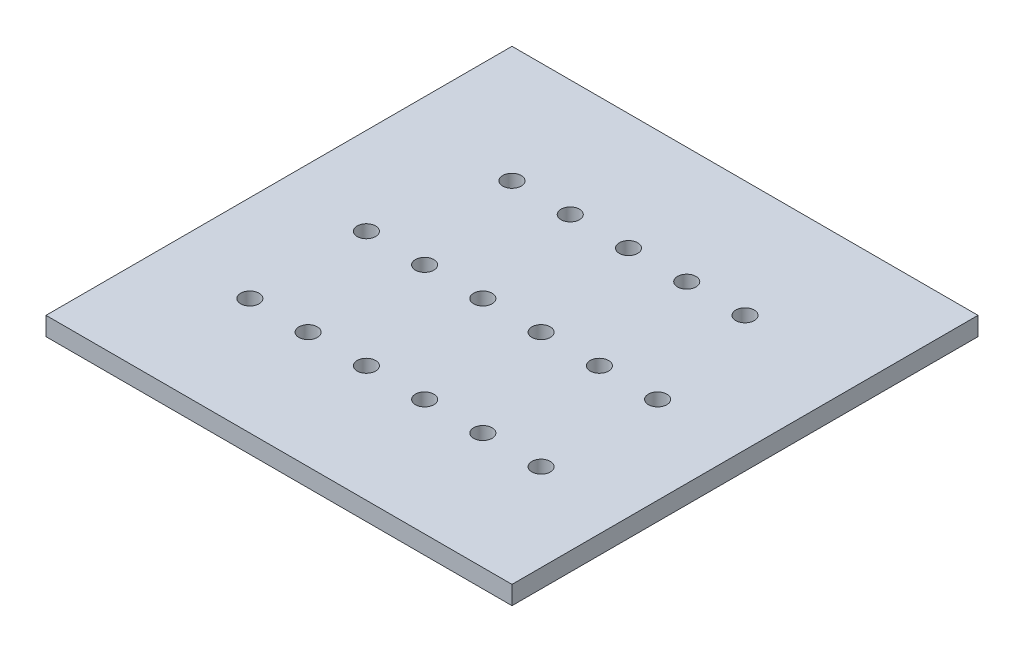
ISO-10303-21;
HEADER;
FILE_DESCRIPTION(('STEP AP214'),'2;1');
FILE_NAME('part.step','',(''),(''),'','','');
FILE_SCHEMA(('AUTOMOTIVE_DESIGN { 1 0 10303 214 1 1 1 1 }'));
ENDSEC;
DATA;
#1=APPLICATION_CONTEXT('core data for automotive mechanical design processes');
#2=APPLICATION_PROTOCOL_DEFINITION('international standard','automotive_design',2000,#1);
#3=PRODUCT_CONTEXT('',#1,'mechanical');
#4=PRODUCT('Part','Part','',(#3));
#5=PRODUCT_RELATED_PRODUCT_CATEGORY('part','',(#4));
#6=PRODUCT_DEFINITION_FORMATION('','',#4);
#7=PRODUCT_DEFINITION_CONTEXT('part definition',#1,'design');
#8=PRODUCT_DEFINITION('design','',#6,#7);
#9=PRODUCT_DEFINITION_SHAPE('','',#8);
#10=(LENGTH_UNIT() NAMED_UNIT(*) SI_UNIT(.MILLI.,.METRE.));
#11=(NAMED_UNIT(*) PLANE_ANGLE_UNIT() SI_UNIT($,.RADIAN.));
#12=(NAMED_UNIT(*) SI_UNIT($,.STERADIAN.) SOLID_ANGLE_UNIT());
#13=UNCERTAINTY_MEASURE_WITH_UNIT(LENGTH_MEASURE(1.E-05),#10,'distance_accuracy_value','');
#14=(GEOMETRIC_REPRESENTATION_CONTEXT(3) GLOBAL_UNCERTAINTY_ASSIGNED_CONTEXT((#13)) GLOBAL_UNIT_ASSIGNED_CONTEXT((#10,
#11,#12)) REPRESENTATION_CONTEXT('',''));
#15=CARTESIAN_POINT('',(0.,0.,0.));
#16=DIRECTION('',(0.,0.,1.));
#17=DIRECTION('',(1.,0.,0.));
#18=AXIS2_PLACEMENT_3D('',#15,#16,#17);
#19=CARTESIAN_POINT('',(0.,4.7625,0.));
#20=DIRECTION('',(0.,-1.,0.));
#21=DIRECTION('',(0.,0.,-1.));
#22=AXIS2_PLACEMENT_3D('',#19,#20,#21);
#23=PLANE('',#22);
#24=CARTESIAN_POINT('',(82.5,4.7625,-30.));
#25=DIRECTION('',(0.,1.,0.));
#26=DIRECTION('',(0.,0.,1.));
#27=AXIS2_PLACEMENT_3D('',#24,#25,#26);
#28=CIRCLE('',#27,2.375);
#29=CARTESIAN_POINT('',(82.5,4.7625,-27.625));
#30=VERTEX_POINT('',#29);
#31=EDGE_CURVE('E200',#30,#30,#28,.T.);
#32=ORIENTED_EDGE('',*,*,#31,.F.);
#33=EDGE_LOOP('',(#32));
#34=FACE_BOUND('',#33,.T.);
#35=CARTESIAN_POINT('',(52.5,4.7625,-30.));
#36=DIRECTION('',(0.,1.,0.));
#37=DIRECTION('',(0.,0.,1.));
#38=AXIS2_PLACEMENT_3D('',#35,#36,#37);
#39=CIRCLE('',#38,2.375);
#40=CARTESIAN_POINT('',(52.5,4.7625,-27.625));
#41=VERTEX_POINT('',#40);
#42=EDGE_CURVE('E188',#41,#41,#39,.T.);
#43=ORIENTED_EDGE('',*,*,#42,.F.);
#44=EDGE_LOOP('',(#43));
#45=FACE_BOUND('',#44,.T.);
#46=CARTESIAN_POINT('',(22.5,4.7625,-60.));
#47=DIRECTION('',(0.,1.,0.));
#48=DIRECTION('',(0.,0.,-1.));
#49=AXIS2_PLACEMENT_3D('',#46,#47,#48);
#50=CIRCLE('',#49,2.375);
#51=CARTESIAN_POINT('',(22.5,4.7625,-62.375));
#52=VERTEX_POINT('',#51);
#53=EDGE_CURVE('E176',#52,#52,#50,.T.);
#54=ORIENTED_EDGE('',*,*,#53,.F.);
#55=EDGE_LOOP('',(#54));
#56=FACE_BOUND('',#55,.T.);
#57=CARTESIAN_POINT('',(37.5,4.7625,-60.));
#58=DIRECTION('',(0.,1.,0.));
#59=DIRECTION('',(0.,0.,-1.));
#60=AXIS2_PLACEMENT_3D('',#57,#58,#59);
#61=CIRCLE('',#60,2.375);
#62=CARTESIAN_POINT('',(37.5,4.7625,-62.375));
#63=VERTEX_POINT('',#62);
#64=EDGE_CURVE('E164',#63,#63,#61,.T.);
#65=ORIENTED_EDGE('',*,*,#64,.F.);
#66=EDGE_LOOP('',(#65));
#67=FACE_BOUND('',#66,.T.);
#68=CARTESIAN_POINT('',(67.4999999999999,4.7625,-60.));
#69=DIRECTION('',(0.,1.,0.));
#70=DIRECTION('',(0.,0.,-1.));
#71=AXIS2_PLACEMENT_3D('',#68,#69,#70);
#72=CIRCLE('',#71,2.375);
#73=CARTESIAN_POINT('',(67.4999999999999,4.7625,-62.375));
#74=VERTEX_POINT('',#73);
#75=EDGE_CURVE('E152',#74,#74,#72,.T.);
#76=ORIENTED_EDGE('',*,*,#75,.F.);
#77=EDGE_LOOP('',(#76));
#78=FACE_BOUND('',#77,.T.);
#79=CARTESIAN_POINT('',(97.4999999999999,4.7625,-60.));
#80=DIRECTION('',(0.,1.,0.));
#81=DIRECTION('',(0.,0.,-1.));
#82=AXIS2_PLACEMENT_3D('',#79,#80,#81);
#83=CIRCLE('',#82,2.375);
#84=CARTESIAN_POINT('',(97.4999999999999,4.7625,-62.375));
#85=VERTEX_POINT('',#84);
#86=EDGE_CURVE('E140',#85,#85,#83,.T.);
#87=ORIENTED_EDGE('',*,*,#86,.F.);
#88=EDGE_LOOP('',(#87));
#89=FACE_BOUND('',#88,.T.);
#90=CARTESIAN_POINT('',(75.,4.7625,-90.));
#91=DIRECTION('',(0.,1.,0.));
#92=DIRECTION('',(0.,0.,1.));
#93=AXIS2_PLACEMENT_3D('',#90,#91,#92);
#94=CIRCLE('',#93,2.375);
#95=CARTESIAN_POINT('',(75.,4.7625,-87.625));
#96=VERTEX_POINT('',#95);
#97=EDGE_CURVE('E128',#96,#96,#94,.T.);
#98=ORIENTED_EDGE('',*,*,#97,.F.);
#99=EDGE_LOOP('',(#98));
#100=FACE_BOUND('',#99,.T.);
#101=CARTESIAN_POINT('',(45.,4.7625,-90.));
#102=DIRECTION('',(0.,1.,0.));
#103=DIRECTION('',(0.,0.,1.));
#104=AXIS2_PLACEMENT_3D('',#101,#102,#103);
#105=CIRCLE('',#104,2.375);
#106=CARTESIAN_POINT('',(45.,4.7625,-87.625));
#107=VERTEX_POINT('',#106);
#108=EDGE_CURVE('E116',#107,#107,#105,.T.);
#109=ORIENTED_EDGE('',*,*,#108,.F.);
#110=EDGE_LOOP('',(#109));
#111=FACE_BOUND('',#110,.T.);
#112=DIRECTION('',(0.,0.,1.));
#113=VECTOR('',#112,1.);
#114=CARTESIAN_POINT('',(0.,4.7625,0.));
#115=LINE('',#114,#113);
#116=CARTESIAN_POINT('',(0.,4.7625,-120.));
#117=VERTEX_POINT('',#116);
#118=CARTESIAN_POINT('',(0.,4.7625,0.));
#119=VERTEX_POINT('',#118);
#120=EDGE_CURVE('E86',#117,#119,#115,.T.);
#121=ORIENTED_EDGE('',*,*,#120,.T.);
#122=DIRECTION('',(1.,0.,0.));
#123=VECTOR('',#122,1.);
#124=CARTESIAN_POINT('',(0.,4.7625,0.));
#125=LINE('',#124,#123);
#126=CARTESIAN_POINT('',(120.,4.7625,0.));
#127=VERTEX_POINT('',#126);
#128=EDGE_CURVE('E81',#119,#127,#125,.T.);
#129=ORIENTED_EDGE('',*,*,#128,.T.);
#130=DIRECTION('',(0.,0.,-1.));
#131=VECTOR('',#130,1.);
#132=CARTESIAN_POINT('',(120.,4.7625,0.));
#133=LINE('',#132,#131);
#134=CARTESIAN_POINT('',(120.,4.7625,-120.));
#135=VERTEX_POINT('',#134);
#136=EDGE_CURVE('E84',#127,#135,#133,.T.);
#137=ORIENTED_EDGE('',*,*,#136,.T.);
#138=DIRECTION('',(-1.,0.,0.));
#139=VECTOR('',#138,1.);
#140=CARTESIAN_POINT('',(0.,4.7625,-120.));
#141=LINE('',#140,#139);
#142=EDGE_CURVE('E51',#135,#117,#141,.T.);
#143=ORIENTED_EDGE('',*,*,#142,.T.);
#144=EDGE_LOOP('',(#121,#129,#137,#143));
#145=FACE_BOUND('',#144,.T.);
#146=CARTESIAN_POINT('',(30.,4.7625,-90.));
#147=DIRECTION('',(0.,1.,0.));
#148=DIRECTION('',(0.,0.,1.));
#149=AXIS2_PLACEMENT_3D('',#146,#147,#148);
#150=CIRCLE('',#149,2.375);
#151=CARTESIAN_POINT('',(30.,4.7625,-87.625));
#152=VERTEX_POINT('',#151);
#153=EDGE_CURVE('E101',#152,#152,#150,.T.);
#154=ORIENTED_EDGE('',*,*,#153,.F.);
#155=EDGE_LOOP('',(#154));
#156=FACE_BOUND('',#155,.T.);
#157=CARTESIAN_POINT('',(60.,4.7625,-90.));
#158=DIRECTION('',(0.,1.,0.));
#159=DIRECTION('',(0.,0.,1.));
#160=AXIS2_PLACEMENT_3D('',#157,#158,#159);
#161=CIRCLE('',#160,2.375);
#162=CARTESIAN_POINT('',(60.,4.7625,-87.625));
#163=VERTEX_POINT('',#162);
#164=EDGE_CURVE('E122',#163,#163,#161,.T.);
#165=ORIENTED_EDGE('',*,*,#164,.F.);
#166=EDGE_LOOP('',(#165));
#167=FACE_BOUND('',#166,.T.);
#168=CARTESIAN_POINT('',(90.,4.7625,-90.));
#169=DIRECTION('',(0.,1.,0.));
#170=DIRECTION('',(0.,0.,1.));
#171=AXIS2_PLACEMENT_3D('',#168,#169,#170);
#172=CIRCLE('',#171,2.375);
#173=CARTESIAN_POINT('',(90.,4.7625,-87.625));
#174=VERTEX_POINT('',#173);
#175=EDGE_CURVE('E134',#174,#174,#172,.T.);
#176=ORIENTED_EDGE('',*,*,#175,.F.);
#177=EDGE_LOOP('',(#176));
#178=FACE_BOUND('',#177,.T.);
#179=CARTESIAN_POINT('',(82.4999999999999,4.7625,-60.));
#180=DIRECTION('',(0.,1.,0.));
#181=DIRECTION('',(0.,0.,-1.));
#182=AXIS2_PLACEMENT_3D('',#179,#180,#181);
#183=CIRCLE('',#182,2.375);
#184=CARTESIAN_POINT('',(82.4999999999999,4.7625,-62.375));
#185=VERTEX_POINT('',#184);
#186=EDGE_CURVE('E146',#185,#185,#183,.T.);
#187=ORIENTED_EDGE('',*,*,#186,.F.);
#188=EDGE_LOOP('',(#187));
#189=FACE_BOUND('',#188,.T.);
#190=CARTESIAN_POINT('',(52.5,4.7625,-60.));
#191=DIRECTION('',(0.,1.,0.));
#192=DIRECTION('',(0.,0.,-1.));
#193=AXIS2_PLACEMENT_3D('',#190,#191,#192);
#194=CIRCLE('',#193,2.375);
#195=CARTESIAN_POINT('',(52.5,4.7625,-62.375));
#196=VERTEX_POINT('',#195);
#197=EDGE_CURVE('E158',#196,#196,#194,.T.);
#198=ORIENTED_EDGE('',*,*,#197,.F.);
#199=EDGE_LOOP('',(#198));
#200=FACE_BOUND('',#199,.T.);
#201=CARTESIAN_POINT('',(22.5,4.7625,-30.));
#202=DIRECTION('',(0.,1.,0.));
#203=DIRECTION('',(0.,0.,1.));
#204=AXIS2_PLACEMENT_3D('',#201,#202,#203);
#205=CIRCLE('',#204,2.375);
#206=CARTESIAN_POINT('',(22.5,4.7625,-27.625));
#207=VERTEX_POINT('',#206);
#208=EDGE_CURVE('E170',#207,#207,#205,.T.);
#209=ORIENTED_EDGE('',*,*,#208,.F.);
#210=EDGE_LOOP('',(#209));
#211=FACE_BOUND('',#210,.T.);
#212=CARTESIAN_POINT('',(37.5,4.7625,-30.));
#213=DIRECTION('',(0.,1.,0.));
#214=DIRECTION('',(0.,0.,1.));
#215=AXIS2_PLACEMENT_3D('',#212,#213,#214);
#216=CIRCLE('',#215,2.375);
#217=CARTESIAN_POINT('',(37.5,4.7625,-27.625));
#218=VERTEX_POINT('',#217);
#219=EDGE_CURVE('E182',#218,#218,#216,.T.);
#220=ORIENTED_EDGE('',*,*,#219,.F.);
#221=EDGE_LOOP('',(#220));
#222=FACE_BOUND('',#221,.T.);
#223=CARTESIAN_POINT('',(67.5,4.7625,-30.));
#224=DIRECTION('',(0.,1.,0.));
#225=DIRECTION('',(0.,0.,1.));
#226=AXIS2_PLACEMENT_3D('',#223,#224,#225);
#227=CIRCLE('',#226,2.375);
#228=CARTESIAN_POINT('',(67.5,4.7625,-27.625));
#229=VERTEX_POINT('',#228);
#230=EDGE_CURVE('E194',#229,#229,#227,.T.);
#231=ORIENTED_EDGE('',*,*,#230,.F.);
#232=EDGE_LOOP('',(#231));
#233=FACE_BOUND('',#232,.T.);
#234=CARTESIAN_POINT('',(97.5,4.7625,-30.));
#235=DIRECTION('',(0.,1.,0.));
#236=DIRECTION('',(0.,0.,1.));
#237=AXIS2_PLACEMENT_3D('',#234,#235,#236);
#238=CIRCLE('',#237,2.375);
#239=CARTESIAN_POINT('',(97.5,4.7625,-27.625));
#240=VERTEX_POINT('',#239);
#241=EDGE_CURVE('E206',#240,#240,#238,.T.);
#242=ORIENTED_EDGE('',*,*,#241,.F.);
#243=EDGE_LOOP('',(#242));
#244=FACE_BOUND('',#243,.T.);
#245=ADVANCED_FACE('F34',(#34,#45,#56,#67,#78,#89,#100,#111,#145,#156,#167,#178,#189,#200,#211,
#222,#233,#244),#23,.F.);
#246=CARTESIAN_POINT('',(0.,0.,0.));
#247=DIRECTION('',(0.,-1.,0.));
#248=DIRECTION('',(0.,0.,-1.));
#249=AXIS2_PLACEMENT_3D('',#246,#247,#248);
#250=PLANE('',#249);
#251=CARTESIAN_POINT('',(82.5,0.,-30.));
#252=DIRECTION('',(0.,1.,0.));
#253=DIRECTION('',(0.,0.,1.));
#254=AXIS2_PLACEMENT_3D('',#251,#252,#253);
#255=CIRCLE('',#254,2.375);
#256=CARTESIAN_POINT('',(82.5,0.,-27.625));
#257=VERTEX_POINT('',#256);
#258=EDGE_CURVE('E203',#257,#257,#255,.T.);
#259=ORIENTED_EDGE('',*,*,#258,.T.);
#260=EDGE_LOOP('',(#259));
#261=FACE_BOUND('',#260,.T.);
#262=CARTESIAN_POINT('',(52.5,0.,-30.));
#263=DIRECTION('',(0.,1.,0.));
#264=DIRECTION('',(0.,0.,1.));
#265=AXIS2_PLACEMENT_3D('',#262,#263,#264);
#266=CIRCLE('',#265,2.375);
#267=CARTESIAN_POINT('',(52.5,0.,-27.625));
#268=VERTEX_POINT('',#267);
#269=EDGE_CURVE('E191',#268,#268,#266,.T.);
#270=ORIENTED_EDGE('',*,*,#269,.T.);
#271=EDGE_LOOP('',(#270));
#272=FACE_BOUND('',#271,.T.);
#273=CARTESIAN_POINT('',(22.5,0.,-60.));
#274=DIRECTION('',(0.,1.,0.));
#275=DIRECTION('',(0.,0.,-1.));
#276=AXIS2_PLACEMENT_3D('',#273,#274,#275);
#277=CIRCLE('',#276,2.375);
#278=CARTESIAN_POINT('',(22.5,0.,-62.375));
#279=VERTEX_POINT('',#278);
#280=EDGE_CURVE('E179',#279,#279,#277,.T.);
#281=ORIENTED_EDGE('',*,*,#280,.T.);
#282=EDGE_LOOP('',(#281));
#283=FACE_BOUND('',#282,.T.);
#284=CARTESIAN_POINT('',(37.5,0.,-60.));
#285=DIRECTION('',(0.,1.,0.));
#286=DIRECTION('',(0.,0.,-1.));
#287=AXIS2_PLACEMENT_3D('',#284,#285,#286);
#288=CIRCLE('',#287,2.375);
#289=CARTESIAN_POINT('',(37.5,0.,-62.375));
#290=VERTEX_POINT('',#289);
#291=EDGE_CURVE('E167',#290,#290,#288,.T.);
#292=ORIENTED_EDGE('',*,*,#291,.T.);
#293=EDGE_LOOP('',(#292));
#294=FACE_BOUND('',#293,.T.);
#295=CARTESIAN_POINT('',(67.4999999999999,0.,-60.));
#296=DIRECTION('',(0.,1.,0.));
#297=DIRECTION('',(0.,0.,-1.));
#298=AXIS2_PLACEMENT_3D('',#295,#296,#297);
#299=CIRCLE('',#298,2.375);
#300=CARTESIAN_POINT('',(67.4999999999999,0.,-62.375));
#301=VERTEX_POINT('',#300);
#302=EDGE_CURVE('E155',#301,#301,#299,.T.);
#303=ORIENTED_EDGE('',*,*,#302,.T.);
#304=EDGE_LOOP('',(#303));
#305=FACE_BOUND('',#304,.T.);
#306=CARTESIAN_POINT('',(97.4999999999999,0.,-60.));
#307=DIRECTION('',(0.,1.,0.));
#308=DIRECTION('',(0.,0.,-1.));
#309=AXIS2_PLACEMENT_3D('',#306,#307,#308);
#310=CIRCLE('',#309,2.375);
#311=CARTESIAN_POINT('',(97.4999999999999,0.,-62.375));
#312=VERTEX_POINT('',#311);
#313=EDGE_CURVE('E143',#312,#312,#310,.T.);
#314=ORIENTED_EDGE('',*,*,#313,.T.);
#315=EDGE_LOOP('',(#314));
#316=FACE_BOUND('',#315,.T.);
#317=CARTESIAN_POINT('',(75.,0.,-90.));
#318=DIRECTION('',(0.,1.,0.));
#319=DIRECTION('',(0.,0.,1.));
#320=AXIS2_PLACEMENT_3D('',#317,#318,#319);
#321=CIRCLE('',#320,2.375);
#322=CARTESIAN_POINT('',(75.,0.,-87.625));
#323=VERTEX_POINT('',#322);
#324=EDGE_CURVE('E131',#323,#323,#321,.T.);
#325=ORIENTED_EDGE('',*,*,#324,.T.);
#326=EDGE_LOOP('',(#325));
#327=FACE_BOUND('',#326,.T.);
#328=CARTESIAN_POINT('',(45.,0.,-90.));
#329=DIRECTION('',(0.,1.,0.));
#330=DIRECTION('',(0.,0.,1.));
#331=AXIS2_PLACEMENT_3D('',#328,#329,#330);
#332=CIRCLE('',#331,2.375);
#333=CARTESIAN_POINT('',(45.,0.,-87.625));
#334=VERTEX_POINT('',#333);
#335=EDGE_CURVE('E119',#334,#334,#332,.T.);
#336=ORIENTED_EDGE('',*,*,#335,.T.);
#337=EDGE_LOOP('',(#336));
#338=FACE_BOUND('',#337,.T.);
#339=DIRECTION('',(0.,0.,1.));
#340=VECTOR('',#339,1.);
#341=CARTESIAN_POINT('',(0.,0.,0.));
#342=LINE('',#341,#340);
#343=CARTESIAN_POINT('',(0.,0.,-120.));
#344=VERTEX_POINT('',#343);
#345=CARTESIAN_POINT('',(0.,0.,0.));
#346=VERTEX_POINT('',#345);
#347=EDGE_CURVE('E98',#344,#346,#342,.T.);
#348=ORIENTED_EDGE('',*,*,#347,.F.);
#349=DIRECTION('',(-1.,0.,0.));
#350=VECTOR('',#349,1.);
#351=CARTESIAN_POINT('',(0.,0.,-120.));
#352=LINE('',#351,#350);
#353=CARTESIAN_POINT('',(120.,0.,-120.));
#354=VERTEX_POINT('',#353);
#355=EDGE_CURVE('E74',#354,#344,#352,.T.);
#356=ORIENTED_EDGE('',*,*,#355,.F.);
#357=DIRECTION('',(0.,0.,-1.));
#358=VECTOR('',#357,1.);
#359=CARTESIAN_POINT('',(120.,0.,0.));
#360=LINE('',#359,#358);
#361=CARTESIAN_POINT('',(120.,0.,0.));
#362=VERTEX_POINT('',#361);
#363=EDGE_CURVE('E68',#362,#354,#360,.T.);
#364=ORIENTED_EDGE('',*,*,#363,.F.);
#365=DIRECTION('',(1.,0.,0.));
#366=VECTOR('',#365,1.);
#367=CARTESIAN_POINT('',(0.,0.,0.));
#368=LINE('',#367,#366);
#369=EDGE_CURVE('E90',#346,#362,#368,.T.);
#370=ORIENTED_EDGE('',*,*,#369,.F.);
#371=EDGE_LOOP('',(#348,#356,#364,#370));
#372=FACE_BOUND('',#371,.T.);
#373=CARTESIAN_POINT('',(30.,0.,-90.));
#374=DIRECTION('',(0.,1.,0.));
#375=DIRECTION('',(0.,0.,1.));
#376=AXIS2_PLACEMENT_3D('',#373,#374,#375);
#377=CIRCLE('',#376,2.375);
#378=CARTESIAN_POINT('',(30.,0.,-87.625));
#379=VERTEX_POINT('',#378);
#380=EDGE_CURVE('E113',#379,#379,#377,.T.);
#381=ORIENTED_EDGE('',*,*,#380,.T.);
#382=EDGE_LOOP('',(#381));
#383=FACE_BOUND('',#382,.T.);
#384=CARTESIAN_POINT('',(60.,0.,-90.));
#385=DIRECTION('',(0.,1.,0.));
#386=DIRECTION('',(0.,0.,1.));
#387=AXIS2_PLACEMENT_3D('',#384,#385,#386);
#388=CIRCLE('',#387,2.375);
#389=CARTESIAN_POINT('',(60.,0.,-87.625));
#390=VERTEX_POINT('',#389);
#391=EDGE_CURVE('E125',#390,#390,#388,.T.);
#392=ORIENTED_EDGE('',*,*,#391,.T.);
#393=EDGE_LOOP('',(#392));
#394=FACE_BOUND('',#393,.T.);
#395=CARTESIAN_POINT('',(90.,0.,-90.));
#396=DIRECTION('',(0.,1.,0.));
#397=DIRECTION('',(0.,0.,1.));
#398=AXIS2_PLACEMENT_3D('',#395,#396,#397);
#399=CIRCLE('',#398,2.375);
#400=CARTESIAN_POINT('',(90.,0.,-87.625));
#401=VERTEX_POINT('',#400);
#402=EDGE_CURVE('E137',#401,#401,#399,.T.);
#403=ORIENTED_EDGE('',*,*,#402,.T.);
#404=EDGE_LOOP('',(#403));
#405=FACE_BOUND('',#404,.T.);
#406=CARTESIAN_POINT('',(82.4999999999999,0.,-60.));
#407=DIRECTION('',(0.,1.,0.));
#408=DIRECTION('',(0.,0.,-1.));
#409=AXIS2_PLACEMENT_3D('',#406,#407,#408);
#410=CIRCLE('',#409,2.375);
#411=CARTESIAN_POINT('',(82.4999999999999,0.,-62.375));
#412=VERTEX_POINT('',#411);
#413=EDGE_CURVE('E149',#412,#412,#410,.T.);
#414=ORIENTED_EDGE('',*,*,#413,.T.);
#415=EDGE_LOOP('',(#414));
#416=FACE_BOUND('',#415,.T.);
#417=CARTESIAN_POINT('',(52.5,0.,-60.));
#418=DIRECTION('',(0.,1.,0.));
#419=DIRECTION('',(0.,0.,-1.));
#420=AXIS2_PLACEMENT_3D('',#417,#418,#419);
#421=CIRCLE('',#420,2.375);
#422=CARTESIAN_POINT('',(52.5,0.,-62.375));
#423=VERTEX_POINT('',#422);
#424=EDGE_CURVE('E161',#423,#423,#421,.T.);
#425=ORIENTED_EDGE('',*,*,#424,.T.);
#426=EDGE_LOOP('',(#425));
#427=FACE_BOUND('',#426,.T.);
#428=CARTESIAN_POINT('',(22.5,0.,-30.));
#429=DIRECTION('',(0.,1.,0.));
#430=DIRECTION('',(0.,0.,1.));
#431=AXIS2_PLACEMENT_3D('',#428,#429,#430);
#432=CIRCLE('',#431,2.375);
#433=CARTESIAN_POINT('',(22.5,0.,-27.625));
#434=VERTEX_POINT('',#433);
#435=EDGE_CURVE('E173',#434,#434,#432,.T.);
#436=ORIENTED_EDGE('',*,*,#435,.T.);
#437=EDGE_LOOP('',(#436));
#438=FACE_BOUND('',#437,.T.);
#439=CARTESIAN_POINT('',(37.5,0.,-30.));
#440=DIRECTION('',(0.,1.,0.));
#441=DIRECTION('',(0.,0.,1.));
#442=AXIS2_PLACEMENT_3D('',#439,#440,#441);
#443=CIRCLE('',#442,2.375);
#444=CARTESIAN_POINT('',(37.5,0.,-27.625));
#445=VERTEX_POINT('',#444);
#446=EDGE_CURVE('E185',#445,#445,#443,.T.);
#447=ORIENTED_EDGE('',*,*,#446,.T.);
#448=EDGE_LOOP('',(#447));
#449=FACE_BOUND('',#448,.T.);
#450=CARTESIAN_POINT('',(67.5,0.,-30.));
#451=DIRECTION('',(0.,1.,0.));
#452=DIRECTION('',(0.,0.,1.));
#453=AXIS2_PLACEMENT_3D('',#450,#451,#452);
#454=CIRCLE('',#453,2.375);
#455=CARTESIAN_POINT('',(67.5,0.,-27.625));
#456=VERTEX_POINT('',#455);
#457=EDGE_CURVE('E197',#456,#456,#454,.T.);
#458=ORIENTED_EDGE('',*,*,#457,.T.);
#459=EDGE_LOOP('',(#458));
#460=FACE_BOUND('',#459,.T.);
#461=CARTESIAN_POINT('',(97.5,0.,-30.));
#462=DIRECTION('',(0.,1.,0.));
#463=DIRECTION('',(0.,0.,1.));
#464=AXIS2_PLACEMENT_3D('',#461,#462,#463);
#465=CIRCLE('',#464,2.375);
#466=CARTESIAN_POINT('',(97.5,0.,-27.625));
#467=VERTEX_POINT('',#466);
#468=EDGE_CURVE('E209',#467,#467,#465,.T.);
#469=ORIENTED_EDGE('',*,*,#468,.T.);
#470=EDGE_LOOP('',(#469));
#471=FACE_BOUND('',#470,.T.);
#472=ADVANCED_FACE('F109',(#261,#272,#283,#294,#305,#316,#327,#338,#372,#383,#394,#405,#416,
#427,#438,#449,#460,#471),#250,.T.);
#473=CARTESIAN_POINT('',(0.,4.7625,0.));
#474=DIRECTION('',(1.,0.,0.));
#475=DIRECTION('',(0.,0.,-1.));
#476=AXIS2_PLACEMENT_3D('',#473,#474,#475);
#477=PLANE('',#476);
#478=ORIENTED_EDGE('',*,*,#347,.T.);
#479=DIRECTION('',(0.,-1.,0.));
#480=VECTOR('',#479,1.);
#481=CARTESIAN_POINT('',(0.,4.7625,0.));
#482=LINE('',#481,#480);
#483=EDGE_CURVE('E11',#119,#346,#482,.T.);
#484=ORIENTED_EDGE('',*,*,#483,.F.);
#485=ORIENTED_EDGE('',*,*,#120,.F.);
#486=DIRECTION('',(0.,-1.,0.));
#487=VECTOR('',#486,1.);
#488=CARTESIAN_POINT('',(0.,4.7625,-120.));
#489=LINE('',#488,#487);
#490=EDGE_CURVE('E94',#117,#344,#489,.T.);
#491=ORIENTED_EDGE('',*,*,#490,.T.);
#492=EDGE_LOOP('',(#478,#484,#485,#491));
#493=FACE_BOUND('',#492,.T.);
#494=ADVANCED_FACE('F36',(#493),#477,.F.);
#495=CARTESIAN_POINT('',(0.,4.7625,0.));
#496=DIRECTION('',(0.,0.,-1.));
#497=DIRECTION('',(-1.,0.,0.));
#498=AXIS2_PLACEMENT_3D('',#495,#496,#497);
#499=PLANE('',#498);
#500=ORIENTED_EDGE('',*,*,#369,.T.);
#501=DIRECTION('',(0.,-1.,0.));
#502=VECTOR('',#501,1.);
#503=CARTESIAN_POINT('',(120.,4.7625,0.));
#504=LINE('',#503,#502);
#505=EDGE_CURVE('E43',#127,#362,#504,.T.);
#506=ORIENTED_EDGE('',*,*,#505,.F.);
#507=ORIENTED_EDGE('',*,*,#128,.F.);
#508=ORIENTED_EDGE('',*,*,#483,.T.);
#509=EDGE_LOOP('',(#500,#506,#507,#508));
#510=FACE_BOUND('',#509,.T.);
#511=ADVANCED_FACE('F89',(#510),#499,.F.);
#512=CARTESIAN_POINT('',(120.,4.7625,0.));
#513=DIRECTION('',(-1.,0.,0.));
#514=DIRECTION('',(0.,0.,1.));
#515=AXIS2_PLACEMENT_3D('',#512,#513,#514);
#516=PLANE('',#515);
#517=ORIENTED_EDGE('',*,*,#363,.T.);
#518=DIRECTION('',(0.,-1.,0.));
#519=VECTOR('',#518,1.);
#520=CARTESIAN_POINT('',(120.,4.7625,-120.));
#521=LINE('',#520,#519);
#522=EDGE_CURVE('E91',#135,#354,#521,.T.);
#523=ORIENTED_EDGE('',*,*,#522,.F.);
#524=ORIENTED_EDGE('',*,*,#136,.F.);
#525=ORIENTED_EDGE('',*,*,#505,.T.);
#526=EDGE_LOOP('',(#517,#523,#524,#525));
#527=FACE_BOUND('',#526,.T.);
#528=ADVANCED_FACE('F92',(#527),#516,.F.);
#529=CARTESIAN_POINT('',(0.,4.7625,-120.));
#530=DIRECTION('',(0.,0.,1.));
#531=DIRECTION('',(1.,0.,0.));
#532=AXIS2_PLACEMENT_3D('',#529,#530,#531);
#533=PLANE('',#532);
#534=ORIENTED_EDGE('',*,*,#355,.T.);
#535=ORIENTED_EDGE('',*,*,#490,.F.);
#536=ORIENTED_EDGE('',*,*,#142,.F.);
#537=ORIENTED_EDGE('',*,*,#522,.T.);
#538=EDGE_LOOP('',(#534,#535,#536,#537));
#539=FACE_BOUND('',#538,.T.);
#540=ADVANCED_FACE('F106',(#539),#533,.F.);
#541=CARTESIAN_POINT('',(30.,4.7625,-90.));
#542=DIRECTION('',(0.,-1.,0.));
#543=DIRECTION('',(0.,0.,-1.));
#544=AXIS2_PLACEMENT_3D('',#541,#542,#543);
#545=CYLINDRICAL_SURFACE('',#544,2.375);
#546=ORIENTED_EDGE('',*,*,#153,.T.);
#547=EDGE_LOOP('',(#546));
#548=FACE_BOUND('',#547,.T.);
#549=ORIENTED_EDGE('',*,*,#380,.F.);
#550=EDGE_LOOP('',(#549));
#551=FACE_BOUND('',#550,.T.);
#552=ADVANCED_FACE('F229',(#548,#551),#545,.F.);
#553=CARTESIAN_POINT('',(45.,4.7625,-90.));
#554=DIRECTION('',(0.,-1.,0.));
#555=DIRECTION('',(0.,0.,-1.));
#556=AXIS2_PLACEMENT_3D('',#553,#554,#555);
#557=CYLINDRICAL_SURFACE('',#556,2.375);
#558=ORIENTED_EDGE('',*,*,#108,.T.);
#559=EDGE_LOOP('',(#558));
#560=FACE_BOUND('',#559,.T.);
#561=ORIENTED_EDGE('',*,*,#335,.F.);
#562=EDGE_LOOP('',(#561));
#563=FACE_BOUND('',#562,.T.);
#564=ADVANCED_FACE('F275',(#560,#563),#557,.F.);
#565=CARTESIAN_POINT('',(60.,4.7625,-90.));
#566=DIRECTION('',(0.,-1.,0.));
#567=DIRECTION('',(0.,0.,-1.));
#568=AXIS2_PLACEMENT_3D('',#565,#566,#567);
#569=CYLINDRICAL_SURFACE('',#568,2.375);
#570=ORIENTED_EDGE('',*,*,#164,.T.);
#571=EDGE_LOOP('',(#570));
#572=FACE_BOUND('',#571,.T.);
#573=ORIENTED_EDGE('',*,*,#391,.F.);
#574=EDGE_LOOP('',(#573));
#575=FACE_BOUND('',#574,.T.);
#576=ADVANCED_FACE('F283',(#572,#575),#569,.F.);
#577=CARTESIAN_POINT('',(75.,4.7625,-90.));
#578=DIRECTION('',(0.,-1.,0.));
#579=DIRECTION('',(0.,0.,-1.));
#580=AXIS2_PLACEMENT_3D('',#577,#578,#579);
#581=CYLINDRICAL_SURFACE('',#580,2.375);
#582=ORIENTED_EDGE('',*,*,#97,.T.);
#583=EDGE_LOOP('',(#582));
#584=FACE_BOUND('',#583,.T.);
#585=ORIENTED_EDGE('',*,*,#324,.F.);
#586=EDGE_LOOP('',(#585));
#587=FACE_BOUND('',#586,.T.);
#588=ADVANCED_FACE('F291',(#584,#587),#581,.F.);
#589=CARTESIAN_POINT('',(90.,4.7625,-90.));
#590=DIRECTION('',(0.,-1.,0.));
#591=DIRECTION('',(0.,0.,-1.));
#592=AXIS2_PLACEMENT_3D('',#589,#590,#591);
#593=CYLINDRICAL_SURFACE('',#592,2.375);
#594=ORIENTED_EDGE('',*,*,#175,.T.);
#595=EDGE_LOOP('',(#594));
#596=FACE_BOUND('',#595,.T.);
#597=ORIENTED_EDGE('',*,*,#402,.F.);
#598=EDGE_LOOP('',(#597));
#599=FACE_BOUND('',#598,.T.);
#600=ADVANCED_FACE('F300',(#596,#599),#593,.F.);
#601=CARTESIAN_POINT('',(97.4999999999999,4.7625,-60.));
#602=DIRECTION('',(0.,-1.,0.));
#603=DIRECTION('',(0.,0.,-1.));
#604=AXIS2_PLACEMENT_3D('',#601,#602,#603);
#605=CYLINDRICAL_SURFACE('',#604,2.375);
#606=ORIENTED_EDGE('',*,*,#86,.T.);
#607=EDGE_LOOP('',(#606));
#608=FACE_BOUND('',#607,.T.);
#609=ORIENTED_EDGE('',*,*,#313,.F.);
#610=EDGE_LOOP('',(#609));
#611=FACE_BOUND('',#610,.T.);
#612=ADVANCED_FACE('F309',(#608,#611),#605,.F.);
#613=CARTESIAN_POINT('',(82.4999999999999,4.7625,-60.));
#614=DIRECTION('',(0.,-1.,0.));
#615=DIRECTION('',(0.,0.,-1.));
#616=AXIS2_PLACEMENT_3D('',#613,#614,#615);
#617=CYLINDRICAL_SURFACE('',#616,2.375);
#618=ORIENTED_EDGE('',*,*,#186,.T.);
#619=EDGE_LOOP('',(#618));
#620=FACE_BOUND('',#619,.T.);
#621=ORIENTED_EDGE('',*,*,#413,.F.);
#622=EDGE_LOOP('',(#621));
#623=FACE_BOUND('',#622,.T.);
#624=ADVANCED_FACE('F318',(#620,#623),#617,.F.);
#625=CARTESIAN_POINT('',(67.4999999999999,4.7625,-60.));
#626=DIRECTION('',(0.,-1.,0.));
#627=DIRECTION('',(0.,0.,-1.));
#628=AXIS2_PLACEMENT_3D('',#625,#626,#627);
#629=CYLINDRICAL_SURFACE('',#628,2.375);
#630=ORIENTED_EDGE('',*,*,#75,.T.);
#631=EDGE_LOOP('',(#630));
#632=FACE_BOUND('',#631,.T.);
#633=ORIENTED_EDGE('',*,*,#302,.F.);
#634=EDGE_LOOP('',(#633));
#635=FACE_BOUND('',#634,.T.);
#636=ADVANCED_FACE('F327',(#632,#635),#629,.F.);
#637=CARTESIAN_POINT('',(52.5,4.7625,-60.));
#638=DIRECTION('',(0.,-1.,0.));
#639=DIRECTION('',(0.,0.,-1.));
#640=AXIS2_PLACEMENT_3D('',#637,#638,#639);
#641=CYLINDRICAL_SURFACE('',#640,2.375);
#642=ORIENTED_EDGE('',*,*,#197,.T.);
#643=EDGE_LOOP('',(#642));
#644=FACE_BOUND('',#643,.T.);
#645=ORIENTED_EDGE('',*,*,#424,.F.);
#646=EDGE_LOOP('',(#645));
#647=FACE_BOUND('',#646,.T.);
#648=ADVANCED_FACE('F336',(#644,#647),#641,.F.);
#649=CARTESIAN_POINT('',(37.5,4.7625,-60.));
#650=DIRECTION('',(0.,-1.,0.));
#651=DIRECTION('',(0.,0.,-1.));
#652=AXIS2_PLACEMENT_3D('',#649,#650,#651);
#653=CYLINDRICAL_SURFACE('',#652,2.375);
#654=ORIENTED_EDGE('',*,*,#64,.T.);
#655=EDGE_LOOP('',(#654));
#656=FACE_BOUND('',#655,.T.);
#657=ORIENTED_EDGE('',*,*,#291,.F.);
#658=EDGE_LOOP('',(#657));
#659=FACE_BOUND('',#658,.T.);
#660=ADVANCED_FACE('F345',(#656,#659),#653,.F.);
#661=CARTESIAN_POINT('',(22.5,4.7625,-30.));
#662=DIRECTION('',(0.,-1.,0.));
#663=DIRECTION('',(0.,0.,-1.));
#664=AXIS2_PLACEMENT_3D('',#661,#662,#663);
#665=CYLINDRICAL_SURFACE('',#664,2.375);
#666=ORIENTED_EDGE('',*,*,#208,.T.);
#667=EDGE_LOOP('',(#666));
#668=FACE_BOUND('',#667,.T.);
#669=ORIENTED_EDGE('',*,*,#435,.F.);
#670=EDGE_LOOP('',(#669));
#671=FACE_BOUND('',#670,.T.);
#672=ADVANCED_FACE('F354',(#668,#671),#665,.F.);
#673=CARTESIAN_POINT('',(22.5,4.7625,-60.));
#674=DIRECTION('',(0.,-1.,0.));
#675=DIRECTION('',(0.,0.,-1.));
#676=AXIS2_PLACEMENT_3D('',#673,#674,#675);
#677=CYLINDRICAL_SURFACE('',#676,2.375);
#678=ORIENTED_EDGE('',*,*,#53,.T.);
#679=EDGE_LOOP('',(#678));
#680=FACE_BOUND('',#679,.T.);
#681=ORIENTED_EDGE('',*,*,#280,.F.);
#682=EDGE_LOOP('',(#681));
#683=FACE_BOUND('',#682,.T.);
#684=ADVANCED_FACE('F363',(#680,#683),#677,.F.);
#685=CARTESIAN_POINT('',(37.5,4.7625,-30.));
#686=DIRECTION('',(0.,-1.,0.));
#687=DIRECTION('',(0.,0.,-1.));
#688=AXIS2_PLACEMENT_3D('',#685,#686,#687);
#689=CYLINDRICAL_SURFACE('',#688,2.375);
#690=ORIENTED_EDGE('',*,*,#219,.T.);
#691=EDGE_LOOP('',(#690));
#692=FACE_BOUND('',#691,.T.);
#693=ORIENTED_EDGE('',*,*,#446,.F.);
#694=EDGE_LOOP('',(#693));
#695=FACE_BOUND('',#694,.T.);
#696=ADVANCED_FACE('F372',(#692,#695),#689,.F.);
#697=CARTESIAN_POINT('',(52.5,4.7625,-30.));
#698=DIRECTION('',(0.,-1.,0.));
#699=DIRECTION('',(0.,0.,-1.));
#700=AXIS2_PLACEMENT_3D('',#697,#698,#699);
#701=CYLINDRICAL_SURFACE('',#700,2.375);
#702=ORIENTED_EDGE('',*,*,#42,.T.);
#703=EDGE_LOOP('',(#702));
#704=FACE_BOUND('',#703,.T.);
#705=ORIENTED_EDGE('',*,*,#269,.F.);
#706=EDGE_LOOP('',(#705));
#707=FACE_BOUND('',#706,.T.);
#708=ADVANCED_FACE('F381',(#704,#707),#701,.F.);
#709=CARTESIAN_POINT('',(67.5,4.7625,-30.));
#710=DIRECTION('',(0.,-1.,0.));
#711=DIRECTION('',(0.,0.,-1.));
#712=AXIS2_PLACEMENT_3D('',#709,#710,#711);
#713=CYLINDRICAL_SURFACE('',#712,2.375);
#714=ORIENTED_EDGE('',*,*,#230,.T.);
#715=EDGE_LOOP('',(#714));
#716=FACE_BOUND('',#715,.T.);
#717=ORIENTED_EDGE('',*,*,#457,.F.);
#718=EDGE_LOOP('',(#717));
#719=FACE_BOUND('',#718,.T.);
#720=ADVANCED_FACE('F390',(#716,#719),#713,.F.);
#721=CARTESIAN_POINT('',(82.5,4.7625,-30.));
#722=DIRECTION('',(0.,-1.,0.));
#723=DIRECTION('',(0.,0.,-1.));
#724=AXIS2_PLACEMENT_3D('',#721,#722,#723);
#725=CYLINDRICAL_SURFACE('',#724,2.375);
#726=ORIENTED_EDGE('',*,*,#31,.T.);
#727=EDGE_LOOP('',(#726));
#728=FACE_BOUND('',#727,.T.);
#729=ORIENTED_EDGE('',*,*,#258,.F.);
#730=EDGE_LOOP('',(#729));
#731=FACE_BOUND('',#730,.T.);
#732=ADVANCED_FACE('F399',(#728,#731),#725,.F.);
#733=CARTESIAN_POINT('',(97.5,4.7625,-30.));
#734=DIRECTION('',(0.,-1.,0.));
#735=DIRECTION('',(0.,0.,-1.));
#736=AXIS2_PLACEMENT_3D('',#733,#734,#735);
#737=CYLINDRICAL_SURFACE('',#736,2.375);
#738=ORIENTED_EDGE('',*,*,#241,.T.);
#739=EDGE_LOOP('',(#738));
#740=FACE_BOUND('',#739,.T.);
#741=ORIENTED_EDGE('',*,*,#468,.F.);
#742=EDGE_LOOP('',(#741));
#743=FACE_BOUND('',#742,.T.);
#744=ADVANCED_FACE('F215',(#740,#743),#737,.F.);
#745=CLOSED_SHELL('',(#245,#472,#494,#511,#528,#540,#552,#564,#576,#588,#600,#612,#624,#636,
#648,#660,#672,#684,#696,#708,#720,#732,#744));
#746=MANIFOLD_SOLID_BREP('B2',#745);
#747=ADVANCED_BREP_SHAPE_REPRESENTATION('',(#18,#746),#14);
#748=SHAPE_DEFINITION_REPRESENTATION(#9,#747);
ENDSEC;
END-ISO-10303-21;
